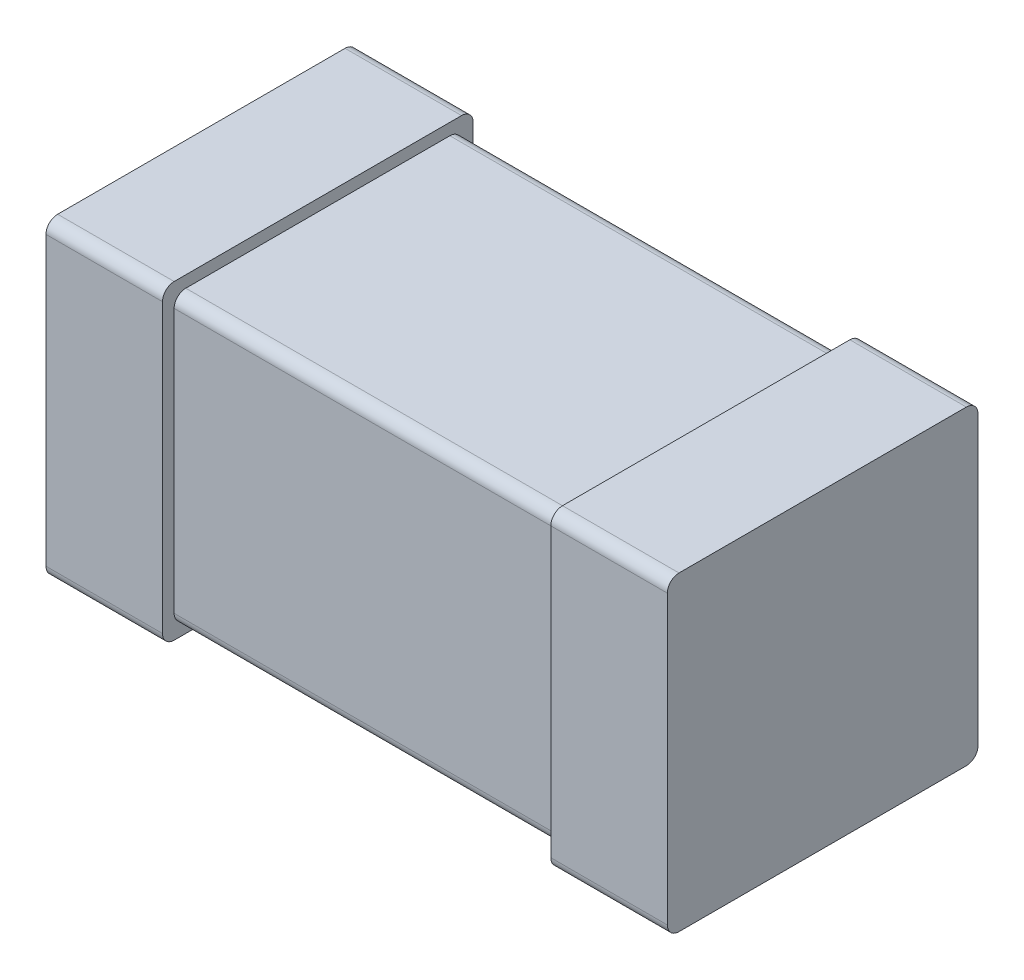
ISO-10303-21;
HEADER;
FILE_DESCRIPTION(('STEP AP214'),'2;1');
FILE_NAME('part.step','',(''),(''),'','','');
FILE_SCHEMA(('AUTOMOTIVE_DESIGN { 1 0 10303 214 1 1 1 1 }'));
ENDSEC;
DATA;
#1=APPLICATION_CONTEXT('core data for automotive mechanical design processes');
#2=APPLICATION_PROTOCOL_DEFINITION('international standard','automotive_design',2000,#1);
#3=PRODUCT_CONTEXT('',#1,'mechanical');
#4=PRODUCT('Part','Part','',(#3));
#5=PRODUCT_RELATED_PRODUCT_CATEGORY('part','',(#4));
#6=PRODUCT_DEFINITION_FORMATION('','',#4);
#7=PRODUCT_DEFINITION_CONTEXT('part definition',#1,'design');
#8=PRODUCT_DEFINITION('design','',#6,#7);
#9=PRODUCT_DEFINITION_SHAPE('','',#8);
#10=(LENGTH_UNIT() NAMED_UNIT(*) SI_UNIT(.MILLI.,.METRE.));
#11=(NAMED_UNIT(*) PLANE_ANGLE_UNIT() SI_UNIT($,.RADIAN.));
#12=(NAMED_UNIT(*) SI_UNIT($,.STERADIAN.) SOLID_ANGLE_UNIT());
#13=UNCERTAINTY_MEASURE_WITH_UNIT(LENGTH_MEASURE(1.E-05),#10,'distance_accuracy_value','');
#14=(GEOMETRIC_REPRESENTATION_CONTEXT(3) GLOBAL_UNCERTAINTY_ASSIGNED_CONTEXT((#13)) GLOBAL_UNIT_ASSIGNED_CONTEXT((#10,
#11,#12)) REPRESENTATION_CONTEXT('',''));
#15=CARTESIAN_POINT('',(0.,0.,0.));
#16=DIRECTION('',(0.,0.,1.));
#17=DIRECTION('',(1.,0.,0.));
#18=AXIS2_PLACEMENT_3D('',#15,#16,#17);
#19=CARTESIAN_POINT('',(194.464744279938,95.7010432923502,112.211582908599));
#20=DIRECTION('',(-1.,0.,0.));
#21=DIRECTION('',(0.,0.,1.));
#22=AXIS2_PLACEMENT_3D('',#19,#20,#21);
#23=PLANE('',#22);
#24=DIRECTION('',(0.,0.,1.));
#25=VECTOR('',#24,1.);
#26=CARTESIAN_POINT('',(194.464744279938,95.7010432923502,112.211582908599));
#27=LINE('',#26,#25);
#28=CARTESIAN_POINT('',(194.464744279938,95.7010432923502,112.241582908599));
#29=VERTEX_POINT('',#28);
#30=CARTESIAN_POINT('',(194.464744279938,95.7010432923502,112.981582908599));
#31=VERTEX_POINT('',#30);
#32=EDGE_CURVE('E67',#29,#31,#27,.T.);
#33=ORIENTED_EDGE('',*,*,#32,.F.);
#34=CARTESIAN_POINT('',(194.464744279938,95.6710432923502,112.241582908599));
#35=DIRECTION('',(-1.,0.,0.));
#36=DIRECTION('',(0.,0.,1.));
#37=AXIS2_PLACEMENT_3D('',#34,#35,#36);
#38=CIRCLE('',#37,0.0300000000000023);
#39=CARTESIAN_POINT('',(194.464744279938,95.6710432923502,112.211582908599));
#40=VERTEX_POINT('',#39);
#41=EDGE_CURVE('E11',#29,#40,#38,.T.);
#42=ORIENTED_EDGE('',*,*,#41,.T.);
#43=DIRECTION('',(0.,-1.,0.));
#44=VECTOR('',#43,1.);
#45=CARTESIAN_POINT('',(194.464744279938,95.7010432923502,112.211582908599));
#46=LINE('',#45,#44);
#47=CARTESIAN_POINT('',(194.464744279938,94.9310432923502,112.211582908599));
#48=VERTEX_POINT('',#47);
#49=EDGE_CURVE('E55',#40,#48,#46,.T.);
#50=ORIENTED_EDGE('',*,*,#49,.T.);
#51=CARTESIAN_POINT('',(194.464744279938,94.9310432923502,112.241582908599));
#52=DIRECTION('',(1.,0.,0.));
#53=DIRECTION('',(0.,0.,1.));
#54=AXIS2_PLACEMENT_3D('',#51,#52,#53);
#55=CIRCLE('',#54,0.0300000000000023);
#56=CARTESIAN_POINT('',(194.464744279938,94.9010432923502,112.241582908599));
#57=VERTEX_POINT('',#56);
#58=EDGE_CURVE('E303',#57,#48,#55,.T.);
#59=ORIENTED_EDGE('',*,*,#58,.F.);
#60=DIRECTION('',(0.,0.,1.));
#61=VECTOR('',#60,1.);
#62=CARTESIAN_POINT('',(194.464744279938,94.9010432923502,112.211582908599));
#63=LINE('',#62,#61);
#64=CARTESIAN_POINT('',(194.464744279938,94.9010432923502,112.981582908599));
#65=VERTEX_POINT('',#64);
#66=EDGE_CURVE('E358',#57,#65,#63,.T.);
#67=ORIENTED_EDGE('',*,*,#66,.T.);
#68=CARTESIAN_POINT('',(194.464744279938,94.9310432923502,112.981582908599));
#69=DIRECTION('',(-1.,0.,0.));
#70=DIRECTION('',(0.,0.,1.));
#71=AXIS2_PLACEMENT_3D('',#68,#69,#70);
#72=CIRCLE('',#71,0.0300000000000023);
#73=CARTESIAN_POINT('',(194.464744279938,94.9310432923502,113.011582908599));
#74=VERTEX_POINT('',#73);
#75=EDGE_CURVE('E294',#65,#74,#72,.T.);
#76=ORIENTED_EDGE('',*,*,#75,.T.);
#77=DIRECTION('',(0.,-1.,0.));
#78=VECTOR('',#77,1.);
#79=CARTESIAN_POINT('',(194.464744279938,95.7010432923502,113.011582908599));
#80=LINE('',#79,#78);
#81=CARTESIAN_POINT('',(194.464744279938,95.6710432923502,113.011582908599));
#82=VERTEX_POINT('',#81);
#83=EDGE_CURVE('E277',#82,#74,#80,.T.);
#84=ORIENTED_EDGE('',*,*,#83,.F.);
#85=CARTESIAN_POINT('',(194.464744279938,95.6710432923502,112.981582908599));
#86=DIRECTION('',(1.,0.,0.));
#87=DIRECTION('',(0.,0.,1.));
#88=AXIS2_PLACEMENT_3D('',#85,#86,#87);
#89=CIRCLE('',#88,0.0300000000000023);
#90=EDGE_CURVE('E284',#31,#82,#89,.T.);
#91=ORIENTED_EDGE('',*,*,#90,.F.);
#92=EDGE_LOOP('',(#33,#42,#50,#59,#67,#76,#84,#91));
#93=FACE_BOUND('',#92,.T.);
#94=ADVANCED_FACE('F44',(#93),#23,.T.);
#95=CARTESIAN_POINT('',(194.764744279938,94.9010432923502,112.211582908599));
#96=DIRECTION('',(0.,-1.,0.));
#97=DIRECTION('',(0.,0.,-1.));
#98=AXIS2_PLACEMENT_3D('',#95,#96,#97);
#99=PLANE('',#98);
#100=ORIENTED_EDGE('',*,*,#66,.F.);
#101=DIRECTION('',(-1.,0.,0.));
#102=VECTOR('',#101,1.);
#103=CARTESIAN_POINT('',(194.764744279938,94.9010432923502,112.241582908599));
#104=LINE('',#103,#102);
#105=CARTESIAN_POINT('',(194.764744279938,94.9010432923502,112.241582908599));
#106=VERTEX_POINT('',#105);
#107=EDGE_CURVE('E309',#106,#57,#104,.T.);
#108=ORIENTED_EDGE('',*,*,#107,.F.);
#109=DIRECTION('',(0.,0.,1.));
#110=VECTOR('',#109,1.);
#111=CARTESIAN_POINT('',(194.764744279938,94.9010432923502,112.211582908599));
#112=LINE('',#111,#110);
#113=CARTESIAN_POINT('',(194.764744279938,94.9010432923502,112.981582908599));
#114=VERTEX_POINT('',#113);
#115=EDGE_CURVE('E363',#106,#114,#112,.T.);
#116=ORIENTED_EDGE('',*,*,#115,.T.);
#117=DIRECTION('',(-1.,0.,0.));
#118=VECTOR('',#117,1.);
#119=CARTESIAN_POINT('',(194.764744279938,94.9010432923502,112.981582908599));
#120=LINE('',#119,#118);
#121=EDGE_CURVE('E372',#114,#65,#120,.T.);
#122=ORIENTED_EDGE('',*,*,#121,.T.);
#123=EDGE_LOOP('',(#100,#108,#116,#122));
#124=FACE_BOUND('',#123,.T.);
#125=ADVANCED_FACE('F592',(#124),#99,.T.);
#126=CARTESIAN_POINT('',(194.764744279938,94.9310432923502,112.981582908599));
#127=DIRECTION('',(-1.,0.,0.));
#128=DIRECTION('',(0.,-1.,0.));
#129=AXIS2_PLACEMENT_3D('',#126,#127,#128);
#130=CYLINDRICAL_SURFACE('',#129,0.0300000000000023);
#131=CARTESIAN_POINT('',(194.764744279938,94.9310432923502,112.981582908599));
#132=DIRECTION('',(-1.,0.,0.));
#133=DIRECTION('',(0.,0.,1.));
#134=AXIS2_PLACEMENT_3D('',#131,#132,#133);
#135=CIRCLE('',#134,0.0300000000000023);
#136=CARTESIAN_POINT('',(194.764744279938,94.9310432923502,113.011582908599));
#137=VERTEX_POINT('',#136);
#138=EDGE_CURVE('E415',#114,#137,#135,.T.);
#139=ORIENTED_EDGE('',*,*,#138,.T.);
#140=DIRECTION('',(-1.,0.,0.));
#141=VECTOR('',#140,1.);
#142=CARTESIAN_POINT('',(194.764744279938,94.9310432923502,113.011582908599));
#143=LINE('',#142,#141);
#144=EDGE_CURVE('E413',#137,#74,#143,.T.);
#145=ORIENTED_EDGE('',*,*,#144,.T.);
#146=ORIENTED_EDGE('',*,*,#75,.F.);
#147=ORIENTED_EDGE('',*,*,#121,.F.);
#148=EDGE_LOOP('',(#139,#145,#146,#147));
#149=FACE_BOUND('',#148,.T.);
#150=ADVANCED_FACE('F597',(#149),#130,.T.);
#151=CARTESIAN_POINT('',(194.764744279938,94.9310432923502,112.241582908599));
#152=DIRECTION('',(-1.,0.,0.));
#153=DIRECTION('',(0.,-1.,0.));
#154=AXIS2_PLACEMENT_3D('',#151,#152,#153);
#155=CYLINDRICAL_SURFACE('',#154,0.0300000000000023);
#156=ORIENTED_EDGE('',*,*,#107,.T.);
#157=ORIENTED_EDGE('',*,*,#58,.T.);
#158=DIRECTION('',(-1.,0.,0.));
#159=VECTOR('',#158,1.);
#160=CARTESIAN_POINT('',(194.764744279938,94.9310432923502,112.211582908599));
#161=LINE('',#160,#159);
#162=CARTESIAN_POINT('',(194.764744279938,94.9310432923502,112.211582908599));
#163=VERTEX_POINT('',#162);
#164=EDGE_CURVE('E297',#163,#48,#161,.T.);
#165=ORIENTED_EDGE('',*,*,#164,.F.);
#166=CARTESIAN_POINT('',(194.764744279938,94.9310432923502,112.241582908599));
#167=DIRECTION('',(1.,0.,0.));
#168=DIRECTION('',(0.,0.,1.));
#169=AXIS2_PLACEMENT_3D('',#166,#167,#168);
#170=CIRCLE('',#169,0.0300000000000023);
#171=EDGE_CURVE('E395',#106,#163,#170,.T.);
#172=ORIENTED_EDGE('',*,*,#171,.F.);
#173=EDGE_LOOP('',(#156,#157,#165,#172));
#174=FACE_BOUND('',#173,.T.);
#175=ADVANCED_FACE('F46',(#174),#155,.T.);
#176=CARTESIAN_POINT('',(194.764744279938,95.7010432923502,113.011582908599));
#177=DIRECTION('',(0.,0.,1.));
#178=DIRECTION('',(1.,0.,0.));
#179=AXIS2_PLACEMENT_3D('',#176,#177,#178);
#180=PLANE('',#179);
#181=DIRECTION('',(0.,-1.,0.));
#182=VECTOR('',#181,1.);
#183=CARTESIAN_POINT('',(194.764744279938,95.7010432923502,113.011582908599));
#184=LINE('',#183,#182);
#185=CARTESIAN_POINT('',(194.764744279938,95.6710432923502,113.011582908599));
#186=VERTEX_POINT('',#185);
#187=EDGE_CURVE('E301',#186,#137,#184,.T.);
#188=ORIENTED_EDGE('',*,*,#187,.F.);
#189=DIRECTION('',(-1.,0.,0.));
#190=VECTOR('',#189,1.);
#191=CARTESIAN_POINT('',(194.764744279938,95.6710432923502,113.011582908599));
#192=LINE('',#191,#190);
#193=EDGE_CURVE('E286',#186,#82,#192,.T.);
#194=ORIENTED_EDGE('',*,*,#193,.T.);
#195=ORIENTED_EDGE('',*,*,#83,.T.);
#196=ORIENTED_EDGE('',*,*,#144,.F.);
#197=EDGE_LOOP('',(#188,#194,#195,#196));
#198=FACE_BOUND('',#197,.T.);
#199=ADVANCED_FACE('F299',(#198),#180,.T.);
#200=CARTESIAN_POINT('',(194.764744279938,95.7010432923502,112.211582908599));
#201=DIRECTION('',(0.,0.,1.));
#202=DIRECTION('',(1.,0.,0.));
#203=AXIS2_PLACEMENT_3D('',#200,#201,#202);
#204=PLANE('',#203);
#205=ORIENTED_EDGE('',*,*,#164,.T.);
#206=ORIENTED_EDGE('',*,*,#49,.F.);
#207=DIRECTION('',(-1.,0.,0.));
#208=VECTOR('',#207,1.);
#209=CARTESIAN_POINT('',(194.764744279938,95.6710432923502,112.211582908599));
#210=LINE('',#209,#208);
#211=CARTESIAN_POINT('',(194.764744279938,95.6710432923502,112.211582908599));
#212=VERTEX_POINT('',#211);
#213=EDGE_CURVE('E407',#212,#40,#210,.T.);
#214=ORIENTED_EDGE('',*,*,#213,.F.);
#215=DIRECTION('',(0.,-1.,0.));
#216=VECTOR('',#215,1.);
#217=CARTESIAN_POINT('',(194.764744279938,95.7010432923502,112.211582908599));
#218=LINE('',#217,#216);
#219=EDGE_CURVE('E410',#212,#163,#218,.T.);
#220=ORIENTED_EDGE('',*,*,#219,.T.);
#221=EDGE_LOOP('',(#205,#206,#214,#220));
#222=FACE_BOUND('',#221,.T.);
#223=ADVANCED_FACE('F630',(#222),#204,.F.);
#224=CARTESIAN_POINT('',(194.764744279938,95.6710432923502,112.981582908599));
#225=DIRECTION('',(-1.,0.,0.));
#226=DIRECTION('',(0.,1.,0.));
#227=AXIS2_PLACEMENT_3D('',#224,#225,#226);
#228=CYLINDRICAL_SURFACE('',#227,0.0300000000000023);
#229=DIRECTION('',(-1.,0.,0.));
#230=VECTOR('',#229,1.);
#231=CARTESIAN_POINT('',(194.764744279938,95.7010432923502,112.981582908599));
#232=LINE('',#231,#230);
#233=CARTESIAN_POINT('',(194.764744279938,95.7010432923502,112.981582908599));
#234=VERTEX_POINT('',#233);
#235=EDGE_CURVE('E289',#234,#31,#232,.T.);
#236=ORIENTED_EDGE('',*,*,#235,.T.);
#237=ORIENTED_EDGE('',*,*,#90,.T.);
#238=ORIENTED_EDGE('',*,*,#193,.F.);
#239=CARTESIAN_POINT('',(194.764744279938,95.6710432923502,112.981582908599));
#240=DIRECTION('',(1.,0.,0.));
#241=DIRECTION('',(0.,0.,1.));
#242=AXIS2_PLACEMENT_3D('',#239,#240,#241);
#243=CIRCLE('',#242,0.0300000000000023);
#244=EDGE_CURVE('E328',#234,#186,#243,.T.);
#245=ORIENTED_EDGE('',*,*,#244,.F.);
#246=EDGE_LOOP('',(#236,#237,#238,#245));
#247=FACE_BOUND('',#246,.T.);
#248=ADVANCED_FACE('F285',(#247),#228,.T.);
#249=CARTESIAN_POINT('',(194.764744279938,95.6710432923502,112.241582908599));
#250=DIRECTION('',(-1.,0.,0.));
#251=DIRECTION('',(0.,1.,0.));
#252=AXIS2_PLACEMENT_3D('',#249,#250,#251);
#253=CYLINDRICAL_SURFACE('',#252,0.0300000000000023);
#254=CARTESIAN_POINT('',(194.764744279938,95.6710432923502,112.241582908599));
#255=DIRECTION('',(-1.,0.,0.));
#256=DIRECTION('',(0.,0.,1.));
#257=AXIS2_PLACEMENT_3D('',#254,#255,#256);
#258=CIRCLE('',#257,0.0300000000000023);
#259=CARTESIAN_POINT('',(194.764744279938,95.7010432923502,112.241582908599));
#260=VERTEX_POINT('',#259);
#261=EDGE_CURVE('E291',#260,#212,#258,.T.);
#262=ORIENTED_EDGE('',*,*,#261,.T.);
#263=ORIENTED_EDGE('',*,*,#213,.T.);
#264=ORIENTED_EDGE('',*,*,#41,.F.);
#265=DIRECTION('',(-1.,0.,0.));
#266=VECTOR('',#265,1.);
#267=CARTESIAN_POINT('',(194.764744279938,95.7010432923502,112.241582908599));
#268=LINE('',#267,#266);
#269=EDGE_CURVE('E48',#260,#29,#268,.T.);
#270=ORIENTED_EDGE('',*,*,#269,.F.);
#271=EDGE_LOOP('',(#262,#263,#264,#270));
#272=FACE_BOUND('',#271,.T.);
#273=ADVANCED_FACE('F608',(#272),#253,.T.);
#274=CARTESIAN_POINT('',(194.764744279938,95.7010432923502,112.211582908599));
#275=DIRECTION('',(0.,-1.,0.));
#276=DIRECTION('',(0.,0.,-1.));
#277=AXIS2_PLACEMENT_3D('',#274,#275,#276);
#278=PLANE('',#277);
#279=ORIENTED_EDGE('',*,*,#235,.F.);
#280=DIRECTION('',(0.,0.,1.));
#281=VECTOR('',#280,1.);
#282=CARTESIAN_POINT('',(194.764744279938,95.7010432923502,112.211582908599));
#283=LINE('',#282,#281);
#284=EDGE_CURVE('E391',#260,#234,#283,.T.);
#285=ORIENTED_EDGE('',*,*,#284,.F.);
#286=ORIENTED_EDGE('',*,*,#269,.T.);
#287=ORIENTED_EDGE('',*,*,#32,.T.);
#288=EDGE_LOOP('',(#279,#285,#286,#287));
#289=FACE_BOUND('',#288,.T.);
#290=ADVANCED_FACE('F611',(#289),#278,.F.);
#291=CARTESIAN_POINT('',(194.764744279938,95.7010432923502,112.211582908599));
#292=DIRECTION('',(-1.,0.,0.));
#293=DIRECTION('',(0.,0.,1.));
#294=AXIS2_PLACEMENT_3D('',#291,#292,#293);
#295=PLANE('',#294);
#296=ORIENTED_EDGE('',*,*,#244,.T.);
#297=ORIENTED_EDGE('',*,*,#187,.T.);
#298=ORIENTED_EDGE('',*,*,#138,.F.);
#299=ORIENTED_EDGE('',*,*,#115,.F.);
#300=ORIENTED_EDGE('',*,*,#171,.T.);
#301=ORIENTED_EDGE('',*,*,#219,.F.);
#302=ORIENTED_EDGE('',*,*,#261,.F.);
#303=ORIENTED_EDGE('',*,*,#284,.T.);
#304=EDGE_LOOP('',(#296,#297,#298,#299,#300,#301,#302,#303));
#305=FACE_BOUND('',#304,.T.);
#306=DIRECTION('',(0.,-1.,0.));
#307=VECTOR('',#306,1.);
#308=CARTESIAN_POINT('',(194.764744279938,95.6710432923502,112.241582908599));
#309=LINE('',#308,#307);
#310=CARTESIAN_POINT('',(194.764744279938,95.6410432923502,112.241582908599));
#311=VERTEX_POINT('',#310);
#312=CARTESIAN_POINT('',(194.764744279938,94.9610432923502,112.241582908599));
#313=VERTEX_POINT('',#312);
#314=EDGE_CURVE('E396',#311,#313,#309,.T.);
#315=ORIENTED_EDGE('',*,*,#314,.T.);
#316=CARTESIAN_POINT('',(194.764744279938,94.9610432923502,112.271582908599));
#317=DIRECTION('',(1.,0.,0.));
#318=DIRECTION('',(0.,0.,1.));
#319=AXIS2_PLACEMENT_3D('',#316,#317,#318);
#320=CIRCLE('',#319,0.0300000000000023);
#321=CARTESIAN_POINT('',(194.764744279938,94.9310432923502,112.271582908599));
#322=VERTEX_POINT('',#321);
#323=EDGE_CURVE('E384',#322,#313,#320,.T.);
#324=ORIENTED_EDGE('',*,*,#323,.F.);
#325=DIRECTION('',(0.,0.,1.));
#326=VECTOR('',#325,1.);
#327=CARTESIAN_POINT('',(194.764744279938,94.9310432923502,112.241582908599));
#328=LINE('',#327,#326);
#329=CARTESIAN_POINT('',(194.764744279938,94.9310432923502,112.951582908599));
#330=VERTEX_POINT('',#329);
#331=EDGE_CURVE('E417',#322,#330,#328,.T.);
#332=ORIENTED_EDGE('',*,*,#331,.T.);
#333=CARTESIAN_POINT('',(194.764744279938,94.9610432923502,112.951582908599));
#334=DIRECTION('',(-1.,0.,0.));
#335=DIRECTION('',(0.,0.,1.));
#336=AXIS2_PLACEMENT_3D('',#333,#334,#335);
#337=CIRCLE('',#336,0.0300000000000023);
#338=CARTESIAN_POINT('',(194.764744279938,94.9610432923502,112.981582908599));
#339=VERTEX_POINT('',#338);
#340=EDGE_CURVE('E116',#330,#339,#337,.T.);
#341=ORIENTED_EDGE('',*,*,#340,.T.);
#342=DIRECTION('',(0.,-1.,0.));
#343=VECTOR('',#342,1.);
#344=CARTESIAN_POINT('',(194.764744279938,95.6710432923502,112.981582908599));
#345=LINE('',#344,#343);
#346=CARTESIAN_POINT('',(194.764744279938,95.6410432923502,112.981582908599));
#347=VERTEX_POINT('',#346);
#348=EDGE_CURVE('E132',#347,#339,#345,.T.);
#349=ORIENTED_EDGE('',*,*,#348,.F.);
#350=CARTESIAN_POINT('',(194.764744279938,95.6410432923502,112.951582908599));
#351=DIRECTION('',(1.,0.,0.));
#352=DIRECTION('',(0.,0.,1.));
#353=AXIS2_PLACEMENT_3D('',#350,#351,#352);
#354=CIRCLE('',#353,0.0300000000000023);
#355=CARTESIAN_POINT('',(194.764744279938,95.6710432923502,112.951582908599));
#356=VERTEX_POINT('',#355);
#357=EDGE_CURVE('E344',#356,#347,#354,.T.);
#358=ORIENTED_EDGE('',*,*,#357,.F.);
#359=DIRECTION('',(0.,0.,1.));
#360=VECTOR('',#359,1.);
#361=CARTESIAN_POINT('',(194.764744279938,95.6710432923502,112.241582908599));
#362=LINE('',#361,#360);
#363=CARTESIAN_POINT('',(194.764744279938,95.6710432923502,112.271582908599));
#364=VERTEX_POINT('',#363);
#365=EDGE_CURVE('E173',#364,#356,#362,.T.);
#366=ORIENTED_EDGE('',*,*,#365,.F.);
#367=CARTESIAN_POINT('',(194.764744279938,95.6410432923502,112.271582908599));
#368=DIRECTION('',(-1.,0.,0.));
#369=DIRECTION('',(0.,0.,1.));
#370=AXIS2_PLACEMENT_3D('',#367,#368,#369);
#371=CIRCLE('',#370,0.0300000000000023);
#372=EDGE_CURVE('E182',#364,#311,#371,.T.);
#373=ORIENTED_EDGE('',*,*,#372,.T.);
#374=EDGE_LOOP('',(#315,#324,#332,#341,#349,#358,#366,#373));
#375=FACE_BOUND('',#374,.T.);
#376=ADVANCED_FACE('F513',(#305,#375),#295,.F.);
#377=CARTESIAN_POINT('',(195.764744279938,95.6710432923502,112.241582908599));
#378=DIRECTION('',(0.,-1.,0.));
#379=DIRECTION('',(0.,0.,-1.));
#380=AXIS2_PLACEMENT_3D('',#377,#378,#379);
#381=PLANE('',#380);
#382=DIRECTION('',(-1.,0.,0.));
#383=VECTOR('',#382,1.);
#384=CARTESIAN_POINT('',(195.764744279938,95.6710432923502,112.951582908599));
#385=LINE('',#384,#383);
#386=CARTESIAN_POINT('',(195.764744279938,95.6710432923502,112.951582908599));
#387=VERTEX_POINT('',#386);
#388=EDGE_CURVE('E341',#387,#356,#385,.T.);
#389=ORIENTED_EDGE('',*,*,#388,.F.);
#390=DIRECTION('',(0.,0.,1.));
#391=VECTOR('',#390,1.);
#392=CARTESIAN_POINT('',(195.764744279938,95.6710432923502,112.241582908599));
#393=LINE('',#392,#391);
#394=CARTESIAN_POINT('',(195.764744279938,95.6710432923502,112.271582908599));
#395=VERTEX_POINT('',#394);
#396=EDGE_CURVE('E368',#395,#387,#393,.T.);
#397=ORIENTED_EDGE('',*,*,#396,.F.);
#398=DIRECTION('',(-1.,0.,0.));
#399=VECTOR('',#398,1.);
#400=CARTESIAN_POINT('',(195.764744279938,95.6710432923502,112.271582908599));
#401=LINE('',#400,#399);
#402=EDGE_CURVE('E315',#395,#364,#401,.T.);
#403=ORIENTED_EDGE('',*,*,#402,.T.);
#404=ORIENTED_EDGE('',*,*,#365,.T.);
#405=EDGE_LOOP('',(#389,#397,#403,#404));
#406=FACE_BOUND('',#405,.T.);
#407=ADVANCED_FACE('F577',(#406),#381,.F.);
#408=CARTESIAN_POINT('',(195.764744279938,95.6410432923502,112.951582908599));
#409=DIRECTION('',(-1.,0.,0.));
#410=DIRECTION('',(0.,1.,0.));
#411=AXIS2_PLACEMENT_3D('',#408,#409,#410);
#412=CYLINDRICAL_SURFACE('',#411,0.0300000000000023);
#413=ORIENTED_EDGE('',*,*,#388,.T.);
#414=ORIENTED_EDGE('',*,*,#357,.T.);
#415=DIRECTION('',(-1.,0.,0.));
#416=VECTOR('',#415,1.);
#417=CARTESIAN_POINT('',(195.764744279938,95.6410432923502,112.981582908599));
#418=LINE('',#417,#416);
#419=CARTESIAN_POINT('',(195.764744279938,95.6410432923502,112.981582908599));
#420=VERTEX_POINT('',#419);
#421=EDGE_CURVE('E361',#420,#347,#418,.T.);
#422=ORIENTED_EDGE('',*,*,#421,.F.);
#423=CARTESIAN_POINT('',(195.764744279938,95.6410432923502,112.951582908599));
#424=DIRECTION('',(1.,0.,0.));
#425=DIRECTION('',(0.,0.,1.));
#426=AXIS2_PLACEMENT_3D('',#423,#424,#425);
#427=CIRCLE('',#426,0.0300000000000023);
#428=EDGE_CURVE('E443',#387,#420,#427,.T.);
#429=ORIENTED_EDGE('',*,*,#428,.F.);
#430=EDGE_LOOP('',(#413,#414,#422,#429));
#431=FACE_BOUND('',#430,.T.);
#432=ADVANCED_FACE('F575',(#431),#412,.T.);
#433=CARTESIAN_POINT('',(195.764744279938,95.6710432923502,112.981582908599));
#434=DIRECTION('',(0.,0.,1.));
#435=DIRECTION('',(1.,0.,0.));
#436=AXIS2_PLACEMENT_3D('',#433,#434,#435);
#437=PLANE('',#436);
#438=DIRECTION('',(0.,-1.,0.));
#439=VECTOR('',#438,1.);
#440=CARTESIAN_POINT('',(195.764744279938,95.6710432923502,112.981582908599));
#441=LINE('',#440,#439);
#442=CARTESIAN_POINT('',(195.764744279938,94.9610432923502,112.981582908599));
#443=VERTEX_POINT('',#442);
#444=EDGE_CURVE('E332',#420,#443,#441,.T.);
#445=ORIENTED_EDGE('',*,*,#444,.F.);
#446=ORIENTED_EDGE('',*,*,#421,.T.);
#447=ORIENTED_EDGE('',*,*,#348,.T.);
#448=DIRECTION('',(-1.,0.,0.));
#449=VECTOR('',#448,1.);
#450=CARTESIAN_POINT('',(195.764744279938,94.9610432923502,112.981582908599));
#451=LINE('',#450,#449);
#452=EDGE_CURVE('E318',#443,#339,#451,.T.);
#453=ORIENTED_EDGE('',*,*,#452,.F.);
#454=EDGE_LOOP('',(#445,#446,#447,#453));
#455=FACE_BOUND('',#454,.T.);
#456=ADVANCED_FACE('F570',(#455),#437,.T.);
#457=CARTESIAN_POINT('',(195.764744279938,94.9610432923502,112.951582908599));
#458=DIRECTION('',(-1.,0.,0.));
#459=DIRECTION('',(0.,-1.,0.));
#460=AXIS2_PLACEMENT_3D('',#457,#458,#459);
#461=CYLINDRICAL_SURFACE('',#460,0.0300000000000023);
#462=CARTESIAN_POINT('',(195.764744279938,94.9610432923502,112.951582908599));
#463=DIRECTION('',(-1.,0.,0.));
#464=DIRECTION('',(0.,0.,1.));
#465=AXIS2_PLACEMENT_3D('',#462,#463,#464);
#466=CIRCLE('',#465,0.0300000000000023);
#467=CARTESIAN_POINT('',(195.764744279938,94.9310432923502,112.951582908599));
#468=VERTEX_POINT('',#467);
#469=EDGE_CURVE('E321',#468,#443,#466,.T.);
#470=ORIENTED_EDGE('',*,*,#469,.T.);
#471=ORIENTED_EDGE('',*,*,#452,.T.);
#472=ORIENTED_EDGE('',*,*,#340,.F.);
#473=DIRECTION('',(-1.,0.,0.));
#474=VECTOR('',#473,1.);
#475=CARTESIAN_POINT('',(195.764744279938,94.9310432923502,112.951582908599));
#476=LINE('',#475,#474);
#477=EDGE_CURVE('E379',#468,#330,#476,.T.);
#478=ORIENTED_EDGE('',*,*,#477,.F.);
#479=EDGE_LOOP('',(#470,#471,#472,#478));
#480=FACE_BOUND('',#479,.T.);
#481=ADVANCED_FACE('F568',(#480),#461,.T.);
#482=CARTESIAN_POINT('',(195.764744279938,94.9310432923502,112.241582908599));
#483=DIRECTION('',(0.,-1.,0.));
#484=DIRECTION('',(0.,0.,-1.));
#485=AXIS2_PLACEMENT_3D('',#482,#483,#484);
#486=PLANE('',#485);
#487=ORIENTED_EDGE('',*,*,#331,.F.);
#488=DIRECTION('',(-1.,0.,0.));
#489=VECTOR('',#488,1.);
#490=CARTESIAN_POINT('',(195.764744279938,94.9310432923502,112.271582908599));
#491=LINE('',#490,#489);
#492=CARTESIAN_POINT('',(195.764744279938,94.9310432923502,112.271582908599));
#493=VERTEX_POINT('',#492);
#494=EDGE_CURVE('E383',#493,#322,#491,.T.);
#495=ORIENTED_EDGE('',*,*,#494,.F.);
#496=DIRECTION('',(0.,0.,1.));
#497=VECTOR('',#496,1.);
#498=CARTESIAN_POINT('',(195.764744279938,94.9310432923502,112.241582908599));
#499=LINE('',#498,#497);
#500=EDGE_CURVE('E322',#493,#468,#499,.T.);
#501=ORIENTED_EDGE('',*,*,#500,.T.);
#502=ORIENTED_EDGE('',*,*,#477,.T.);
#503=EDGE_LOOP('',(#487,#495,#501,#502));
#504=FACE_BOUND('',#503,.T.);
#505=ADVANCED_FACE('F527',(#504),#486,.T.);
#506=CARTESIAN_POINT('',(195.764744279938,94.9610432923502,112.271582908599));
#507=DIRECTION('',(-1.,0.,0.));
#508=DIRECTION('',(0.,-1.,0.));
#509=AXIS2_PLACEMENT_3D('',#506,#507,#508);
#510=CYLINDRICAL_SURFACE('',#509,0.0300000000000023);
#511=ORIENTED_EDGE('',*,*,#494,.T.);
#512=ORIENTED_EDGE('',*,*,#323,.T.);
#513=DIRECTION('',(-1.,0.,0.));
#514=VECTOR('',#513,1.);
#515=CARTESIAN_POINT('',(195.764744279938,94.9610432923502,112.241582908599));
#516=LINE('',#515,#514);
#517=CARTESIAN_POINT('',(195.764744279938,94.9610432923502,112.241582908599));
#518=VERTEX_POINT('',#517);
#519=EDGE_CURVE('E387',#518,#313,#516,.T.);
#520=ORIENTED_EDGE('',*,*,#519,.F.);
#521=CARTESIAN_POINT('',(195.764744279938,94.9610432923502,112.271582908599));
#522=DIRECTION('',(1.,0.,0.));
#523=DIRECTION('',(0.,0.,1.));
#524=AXIS2_PLACEMENT_3D('',#521,#522,#523);
#525=CIRCLE('',#524,0.0300000000000023);
#526=EDGE_CURVE('E329',#493,#518,#525,.T.);
#527=ORIENTED_EDGE('',*,*,#526,.F.);
#528=EDGE_LOOP('',(#511,#512,#520,#527));
#529=FACE_BOUND('',#528,.T.);
#530=ADVANCED_FACE('F523',(#529),#510,.T.);
#531=CARTESIAN_POINT('',(195.764744279938,95.6710432923502,112.241582908599));
#532=DIRECTION('',(0.,0.,1.));
#533=DIRECTION('',(1.,0.,0.));
#534=AXIS2_PLACEMENT_3D('',#531,#532,#533);
#535=PLANE('',#534);
#536=ORIENTED_EDGE('',*,*,#519,.T.);
#537=ORIENTED_EDGE('',*,*,#314,.F.);
#538=DIRECTION('',(-1.,0.,0.));
#539=VECTOR('',#538,1.);
#540=CARTESIAN_POINT('',(195.764744279938,95.6410432923502,112.241582908599));
#541=LINE('',#540,#539);
#542=CARTESIAN_POINT('',(195.764744279938,95.6410432923502,112.241582908599));
#543=VERTEX_POINT('',#542);
#544=EDGE_CURVE('E340',#543,#311,#541,.T.);
#545=ORIENTED_EDGE('',*,*,#544,.F.);
#546=DIRECTION('',(0.,-1.,0.));
#547=VECTOR('',#546,1.);
#548=CARTESIAN_POINT('',(195.764744279938,95.6710432923502,112.241582908599));
#549=LINE('',#548,#547);
#550=EDGE_CURVE('E478',#543,#518,#549,.T.);
#551=ORIENTED_EDGE('',*,*,#550,.T.);
#552=EDGE_LOOP('',(#536,#537,#545,#551));
#553=FACE_BOUND('',#552,.T.);
#554=ADVANCED_FACE('F519',(#553),#535,.F.);
#555=CARTESIAN_POINT('',(195.764744279938,95.6410432923502,112.271582908599));
#556=DIRECTION('',(-1.,0.,0.));
#557=DIRECTION('',(0.,1.,0.));
#558=AXIS2_PLACEMENT_3D('',#555,#556,#557);
#559=CYLINDRICAL_SURFACE('',#558,0.0300000000000023);
#560=CARTESIAN_POINT('',(195.764744279938,95.6410432923502,112.271582908599));
#561=DIRECTION('',(-1.,0.,0.));
#562=DIRECTION('',(0.,0.,1.));
#563=AXIS2_PLACEMENT_3D('',#560,#561,#562);
#564=CIRCLE('',#563,0.0300000000000023);
#565=EDGE_CURVE('E508',#395,#543,#564,.T.);
#566=ORIENTED_EDGE('',*,*,#565,.T.);
#567=ORIENTED_EDGE('',*,*,#544,.T.);
#568=ORIENTED_EDGE('',*,*,#372,.F.);
#569=ORIENTED_EDGE('',*,*,#402,.F.);
#570=EDGE_LOOP('',(#566,#567,#568,#569));
#571=FACE_BOUND('',#570,.T.);
#572=ADVANCED_FACE('F580',(#571),#559,.T.);
#573=CARTESIAN_POINT('',(195.764744279938,95.7010432923502,112.211582908599));
#574=DIRECTION('',(-1.,0.,0.));
#575=DIRECTION('',(0.,0.,1.));
#576=AXIS2_PLACEMENT_3D('',#573,#574,#575);
#577=PLANE('',#576);
#578=DIRECTION('',(0.,0.,1.));
#579=VECTOR('',#578,1.);
#580=CARTESIAN_POINT('',(195.764744279938,95.7010432923502,112.211582908599));
#581=LINE('',#580,#579);
#582=CARTESIAN_POINT('',(195.764744279938,95.7010432923502,112.241582908599));
#583=VERTEX_POINT('',#582);
#584=CARTESIAN_POINT('',(195.764744279938,95.7010432923502,112.981582908599));
#585=VERTEX_POINT('',#584);
#586=EDGE_CURVE('E456',#583,#585,#581,.T.);
#587=ORIENTED_EDGE('',*,*,#586,.F.);
#588=CARTESIAN_POINT('',(195.764744279938,95.6710432923502,112.241582908599));
#589=DIRECTION('',(-1.,0.,0.));
#590=DIRECTION('',(0.,0.,1.));
#591=AXIS2_PLACEMENT_3D('',#588,#589,#590);
#592=CIRCLE('',#591,0.0300000000000023);
#593=CARTESIAN_POINT('',(195.764744279938,95.6710432923502,112.211582908599));
#594=VERTEX_POINT('',#593);
#595=EDGE_CURVE('E336',#583,#594,#592,.T.);
#596=ORIENTED_EDGE('',*,*,#595,.T.);
#597=DIRECTION('',(0.,-1.,0.));
#598=VECTOR('',#597,1.);
#599=CARTESIAN_POINT('',(195.764744279938,95.7010432923502,112.211582908599));
#600=LINE('',#599,#598);
#601=CARTESIAN_POINT('',(195.764744279938,94.9310432923502,112.211582908599));
#602=VERTEX_POINT('',#601);
#603=EDGE_CURVE('E259',#594,#602,#600,.T.);
#604=ORIENTED_EDGE('',*,*,#603,.T.);
#605=CARTESIAN_POINT('',(195.764744279938,94.9310432923502,112.241582908599));
#606=DIRECTION('',(1.,0.,0.));
#607=DIRECTION('',(0.,0.,1.));
#608=AXIS2_PLACEMENT_3D('',#605,#606,#607);
#609=CIRCLE('',#608,0.0300000000000023);
#610=CARTESIAN_POINT('',(195.764744279938,94.9010432923502,112.241582908599));
#611=VERTEX_POINT('',#610);
#612=EDGE_CURVE('E248',#611,#602,#609,.T.);
#613=ORIENTED_EDGE('',*,*,#612,.F.);
#614=DIRECTION('',(0.,0.,1.));
#615=VECTOR('',#614,1.);
#616=CARTESIAN_POINT('',(195.764744279938,94.9010432923502,112.211582908599));
#617=LINE('',#616,#615);
#618=CARTESIAN_POINT('',(195.764744279938,94.9010432923502,112.981582908599));
#619=VERTEX_POINT('',#618);
#620=EDGE_CURVE('E337',#611,#619,#617,.T.);
#621=ORIENTED_EDGE('',*,*,#620,.T.);
#622=CARTESIAN_POINT('',(195.764744279938,94.9310432923502,112.981582908599));
#623=DIRECTION('',(-1.,0.,0.));
#624=DIRECTION('',(0.,0.,1.));
#625=AXIS2_PLACEMENT_3D('',#622,#623,#624);
#626=CIRCLE('',#625,0.0300000000000023);
#627=CARTESIAN_POINT('',(195.764744279938,94.9310432923502,113.011582908599));
#628=VERTEX_POINT('',#627);
#629=EDGE_CURVE('E349',#619,#628,#626,.T.);
#630=ORIENTED_EDGE('',*,*,#629,.T.);
#631=DIRECTION('',(0.,-1.,0.));
#632=VECTOR('',#631,1.);
#633=CARTESIAN_POINT('',(195.764744279938,95.7010432923502,113.011582908599));
#634=LINE('',#633,#632);
#635=CARTESIAN_POINT('',(195.764744279938,95.6710432923502,113.011582908599));
#636=VERTEX_POINT('',#635);
#637=EDGE_CURVE('E373',#636,#628,#634,.T.);
#638=ORIENTED_EDGE('',*,*,#637,.F.);
#639=CARTESIAN_POINT('',(195.764744279938,95.6710432923502,112.981582908599));
#640=DIRECTION('',(1.,0.,0.));
#641=DIRECTION('',(0.,0.,1.));
#642=AXIS2_PLACEMENT_3D('',#639,#640,#641);
#643=CIRCLE('',#642,0.0300000000000023);
#644=EDGE_CURVE('E401',#585,#636,#643,.T.);
#645=ORIENTED_EDGE('',*,*,#644,.F.);
#646=EDGE_LOOP('',(#587,#596,#604,#613,#621,#630,#638,#645));
#647=FACE_BOUND('',#646,.T.);
#648=ORIENTED_EDGE('',*,*,#565,.F.);
#649=ORIENTED_EDGE('',*,*,#396,.T.);
#650=ORIENTED_EDGE('',*,*,#428,.T.);
#651=ORIENTED_EDGE('',*,*,#444,.T.);
#652=ORIENTED_EDGE('',*,*,#469,.F.);
#653=ORIENTED_EDGE('',*,*,#500,.F.);
#654=ORIENTED_EDGE('',*,*,#526,.T.);
#655=ORIENTED_EDGE('',*,*,#550,.F.);
#656=EDGE_LOOP('',(#648,#649,#650,#651,#652,#653,#654,#655));
#657=FACE_BOUND('',#656,.T.);
#658=ADVANCED_FACE('F531',(#647,#657),#577,.T.);
#659=CARTESIAN_POINT('',(196.064744279938,94.9010432923502,112.211582908599));
#660=DIRECTION('',(0.,-1.,0.));
#661=DIRECTION('',(0.,0.,-1.));
#662=AXIS2_PLACEMENT_3D('',#659,#660,#661);
#663=PLANE('',#662);
#664=ORIENTED_EDGE('',*,*,#620,.F.);
#665=DIRECTION('',(-1.,0.,0.));
#666=VECTOR('',#665,1.);
#667=CARTESIAN_POINT('',(196.064744279938,94.9010432923502,112.241582908599));
#668=LINE('',#667,#666);
#669=CARTESIAN_POINT('',(196.064744279938,94.9010432923502,112.241582908599));
#670=VERTEX_POINT('',#669);
#671=EDGE_CURVE('E474',#670,#611,#668,.T.);
#672=ORIENTED_EDGE('',*,*,#671,.F.);
#673=DIRECTION('',(0.,0.,1.));
#674=VECTOR('',#673,1.);
#675=CARTESIAN_POINT('',(196.064744279938,94.9010432923502,112.211582908599));
#676=LINE('',#675,#674);
#677=CARTESIAN_POINT('',(196.064744279938,94.9010432923502,112.981582908599));
#678=VERTEX_POINT('',#677);
#679=EDGE_CURVE('E333',#670,#678,#676,.T.);
#680=ORIENTED_EDGE('',*,*,#679,.T.);
#681=DIRECTION('',(-1.,0.,0.));
#682=VECTOR('',#681,1.);
#683=CARTESIAN_POINT('',(196.064744279938,94.9010432923502,112.981582908599));
#684=LINE('',#683,#682);
#685=EDGE_CURVE('E350',#678,#619,#684,.T.);
#686=ORIENTED_EDGE('',*,*,#685,.T.);
#687=EDGE_LOOP('',(#664,#672,#680,#686));
#688=FACE_BOUND('',#687,.T.);
#689=ADVANCED_FACE('F587',(#688),#663,.T.);
#690=CARTESIAN_POINT('',(196.064744279938,94.9310432923502,112.981582908599));
#691=DIRECTION('',(-1.,0.,0.));
#692=DIRECTION('',(0.,-1.,0.));
#693=AXIS2_PLACEMENT_3D('',#690,#691,#692);
#694=CYLINDRICAL_SURFACE('',#693,0.0300000000000023);
#695=CARTESIAN_POINT('',(196.064744279938,94.9310432923502,112.981582908599));
#696=DIRECTION('',(-1.,0.,0.));
#697=DIRECTION('',(0.,0.,1.));
#698=AXIS2_PLACEMENT_3D('',#695,#696,#697);
#699=CIRCLE('',#698,0.0300000000000023);
#700=CARTESIAN_POINT('',(196.064744279938,94.9310432923502,113.011582908599));
#701=VERTEX_POINT('',#700);
#702=EDGE_CURVE('E354',#678,#701,#699,.T.);
#703=ORIENTED_EDGE('',*,*,#702,.T.);
#704=DIRECTION('',(-1.,0.,0.));
#705=VECTOR('',#704,1.);
#706=CARTESIAN_POINT('',(196.064744279938,94.9310432923502,113.011582908599));
#707=LINE('',#706,#705);
#708=EDGE_CURVE('E440',#701,#628,#707,.T.);
#709=ORIENTED_EDGE('',*,*,#708,.T.);
#710=ORIENTED_EDGE('',*,*,#629,.F.);
#711=ORIENTED_EDGE('',*,*,#685,.F.);
#712=EDGE_LOOP('',(#703,#709,#710,#711));
#713=FACE_BOUND('',#712,.T.);
#714=ADVANCED_FACE('F637',(#713),#694,.T.);
#715=CARTESIAN_POINT('',(196.064744279938,94.9310432923502,112.241582908599));
#716=DIRECTION('',(-1.,0.,0.));
#717=DIRECTION('',(0.,-1.,0.));
#718=AXIS2_PLACEMENT_3D('',#715,#716,#717);
#719=CYLINDRICAL_SURFACE('',#718,0.0300000000000023);
#720=ORIENTED_EDGE('',*,*,#671,.T.);
#721=ORIENTED_EDGE('',*,*,#612,.T.);
#722=DIRECTION('',(-1.,0.,0.));
#723=VECTOR('',#722,1.);
#724=CARTESIAN_POINT('',(196.064744279938,94.9310432923502,112.211582908599));
#725=LINE('',#724,#723);
#726=CARTESIAN_POINT('',(196.064744279938,94.9310432923502,112.211582908599));
#727=VERTEX_POINT('',#726);
#728=EDGE_CURVE('E378',#727,#602,#725,.T.);
#729=ORIENTED_EDGE('',*,*,#728,.F.);
#730=CARTESIAN_POINT('',(196.064744279938,94.9310432923502,112.241582908599));
#731=DIRECTION('',(1.,0.,0.));
#732=DIRECTION('',(0.,0.,1.));
#733=AXIS2_PLACEMENT_3D('',#730,#731,#732);
#734=CIRCLE('',#733,0.0300000000000023);
#735=EDGE_CURVE('E460',#670,#727,#734,.T.);
#736=ORIENTED_EDGE('',*,*,#735,.F.);
#737=EDGE_LOOP('',(#720,#721,#729,#736));
#738=FACE_BOUND('',#737,.T.);
#739=ADVANCED_FACE('F607',(#738),#719,.T.);
#740=CARTESIAN_POINT('',(196.064744279938,95.7010432923502,113.011582908599));
#741=DIRECTION('',(0.,0.,1.));
#742=DIRECTION('',(1.,0.,0.));
#743=AXIS2_PLACEMENT_3D('',#740,#741,#742);
#744=PLANE('',#743);
#745=DIRECTION('',(0.,-1.,0.));
#746=VECTOR('',#745,1.);
#747=CARTESIAN_POINT('',(196.064744279938,95.7010432923502,113.011582908599));
#748=LINE('',#747,#746);
#749=CARTESIAN_POINT('',(196.064744279938,95.6710432923502,113.011582908599));
#750=VERTEX_POINT('',#749);
#751=EDGE_CURVE('E457',#750,#701,#748,.T.);
#752=ORIENTED_EDGE('',*,*,#751,.F.);
#753=DIRECTION('',(-1.,0.,0.));
#754=VECTOR('',#753,1.);
#755=CARTESIAN_POINT('',(196.064744279938,95.6710432923502,113.011582908599));
#756=LINE('',#755,#754);
#757=EDGE_CURVE('E377',#750,#636,#756,.T.);
#758=ORIENTED_EDGE('',*,*,#757,.T.);
#759=ORIENTED_EDGE('',*,*,#637,.T.);
#760=ORIENTED_EDGE('',*,*,#708,.F.);
#761=EDGE_LOOP('',(#752,#758,#759,#760));
#762=FACE_BOUND('',#761,.T.);
#763=ADVANCED_FACE('F555',(#762),#744,.T.);
#764=CARTESIAN_POINT('',(196.064744279938,95.7010432923502,112.211582908599));
#765=DIRECTION('',(0.,0.,1.));
#766=DIRECTION('',(1.,0.,0.));
#767=AXIS2_PLACEMENT_3D('',#764,#765,#766);
#768=PLANE('',#767);
#769=ORIENTED_EDGE('',*,*,#728,.T.);
#770=ORIENTED_EDGE('',*,*,#603,.F.);
#771=DIRECTION('',(-1.,0.,0.));
#772=VECTOR('',#771,1.);
#773=CARTESIAN_POINT('',(196.064744279938,95.6710432923502,112.211582908599));
#774=LINE('',#773,#772);
#775=CARTESIAN_POINT('',(196.064744279938,95.6710432923502,112.211582908599));
#776=VERTEX_POINT('',#775);
#777=EDGE_CURVE('E430',#776,#594,#774,.T.);
#778=ORIENTED_EDGE('',*,*,#777,.F.);
#779=DIRECTION('',(0.,-1.,0.));
#780=VECTOR('',#779,1.);
#781=CARTESIAN_POINT('',(196.064744279938,95.7010432923502,112.211582908599));
#782=LINE('',#781,#780);
#783=EDGE_CURVE('E390',#776,#727,#782,.T.);
#784=ORIENTED_EDGE('',*,*,#783,.T.);
#785=EDGE_LOOP('',(#769,#770,#778,#784));
#786=FACE_BOUND('',#785,.T.);
#787=ADVANCED_FACE('F602',(#786),#768,.F.);
#788=CARTESIAN_POINT('',(196.064744279938,95.6710432923502,112.981582908599));
#789=DIRECTION('',(-1.,0.,0.));
#790=DIRECTION('',(0.,1.,0.));
#791=AXIS2_PLACEMENT_3D('',#788,#789,#790);
#792=CYLINDRICAL_SURFACE('',#791,0.0300000000000023);
#793=DIRECTION('',(-1.,0.,0.));
#794=VECTOR('',#793,1.);
#795=CARTESIAN_POINT('',(196.064744279938,95.7010432923502,112.981582908599));
#796=LINE('',#795,#794);
#797=CARTESIAN_POINT('',(196.064744279938,95.7010432923502,112.981582908599));
#798=VERTEX_POINT('',#797);
#799=EDGE_CURVE('E397',#798,#585,#796,.T.);
#800=ORIENTED_EDGE('',*,*,#799,.T.);
#801=ORIENTED_EDGE('',*,*,#644,.T.);
#802=ORIENTED_EDGE('',*,*,#757,.F.);
#803=CARTESIAN_POINT('',(196.064744279938,95.6710432923502,112.981582908599));
#804=DIRECTION('',(1.,0.,0.));
#805=DIRECTION('',(0.,0.,1.));
#806=AXIS2_PLACEMENT_3D('',#803,#804,#805);
#807=CIRCLE('',#806,0.0300000000000023);
#808=EDGE_CURVE('E452',#798,#750,#807,.T.);
#809=ORIENTED_EDGE('',*,*,#808,.F.);
#810=EDGE_LOOP('',(#800,#801,#802,#809));
#811=FACE_BOUND('',#810,.T.);
#812=ADVANCED_FACE('F557',(#811),#792,.T.);
#813=CARTESIAN_POINT('',(196.064744279938,95.6710432923502,112.241582908599));
#814=DIRECTION('',(-1.,0.,0.));
#815=DIRECTION('',(0.,1.,0.));
#816=AXIS2_PLACEMENT_3D('',#813,#814,#815);
#817=CYLINDRICAL_SURFACE('',#816,0.0300000000000023);
#818=CARTESIAN_POINT('',(196.064744279938,95.6710432923502,112.241582908599));
#819=DIRECTION('',(-1.,0.,0.));
#820=DIRECTION('',(0.,0.,1.));
#821=AXIS2_PLACEMENT_3D('',#818,#819,#820);
#822=CIRCLE('',#821,0.0300000000000023);
#823=CARTESIAN_POINT('',(196.064744279938,95.7010432923502,112.241582908599));
#824=VERTEX_POINT('',#823);
#825=EDGE_CURVE('E432',#824,#776,#822,.T.);
#826=ORIENTED_EDGE('',*,*,#825,.T.);
#827=ORIENTED_EDGE('',*,*,#777,.T.);
#828=ORIENTED_EDGE('',*,*,#595,.F.);
#829=DIRECTION('',(-1.,0.,0.));
#830=VECTOR('',#829,1.);
#831=CARTESIAN_POINT('',(196.064744279938,95.7010432923502,112.241582908599));
#832=LINE('',#831,#830);
#833=EDGE_CURVE('E313',#824,#583,#832,.T.);
#834=ORIENTED_EDGE('',*,*,#833,.F.);
#835=EDGE_LOOP('',(#826,#827,#828,#834));
#836=FACE_BOUND('',#835,.T.);
#837=ADVANCED_FACE('F619',(#836),#817,.T.);
#838=CARTESIAN_POINT('',(196.064744279938,95.7010432923502,112.211582908599));
#839=DIRECTION('',(0.,-1.,0.));
#840=DIRECTION('',(0.,0.,-1.));
#841=AXIS2_PLACEMENT_3D('',#838,#839,#840);
#842=PLANE('',#841);
#843=ORIENTED_EDGE('',*,*,#799,.F.);
#844=DIRECTION('',(0.,0.,1.));
#845=VECTOR('',#844,1.);
#846=CARTESIAN_POINT('',(196.064744279938,95.7010432923502,112.211582908599));
#847=LINE('',#846,#845);
#848=EDGE_CURVE('E463',#824,#798,#847,.T.);
#849=ORIENTED_EDGE('',*,*,#848,.F.);
#850=ORIENTED_EDGE('',*,*,#833,.T.);
#851=ORIENTED_EDGE('',*,*,#586,.T.);
#852=EDGE_LOOP('',(#843,#849,#850,#851));
#853=FACE_BOUND('',#852,.T.);
#854=ADVANCED_FACE('F615',(#853),#842,.F.);
#855=CARTESIAN_POINT('',(196.064744279938,95.7010432923502,112.211582908599));
#856=DIRECTION('',(-1.,0.,0.));
#857=DIRECTION('',(0.,0.,1.));
#858=AXIS2_PLACEMENT_3D('',#855,#856,#857);
#859=PLANE('',#858);
#860=ORIENTED_EDGE('',*,*,#808,.T.);
#861=ORIENTED_EDGE('',*,*,#751,.T.);
#862=ORIENTED_EDGE('',*,*,#702,.F.);
#863=ORIENTED_EDGE('',*,*,#679,.F.);
#864=ORIENTED_EDGE('',*,*,#735,.T.);
#865=ORIENTED_EDGE('',*,*,#783,.F.);
#866=ORIENTED_EDGE('',*,*,#825,.F.);
#867=ORIENTED_EDGE('',*,*,#848,.T.);
#868=EDGE_LOOP('',(#860,#861,#862,#863,#864,#865,#866,#867));
#869=FACE_BOUND('',#868,.T.);
#870=ADVANCED_FACE('F551',(#869),#859,.F.);
#871=CLOSED_SHELL('',(#94,#125,#150,#175,#199,#223,#248,#273,#290,#376,#407,#432,#456,#481,#505,
#530,#554,#572,#658,#689,#714,#739,#763,#787,#812,#837,#854,#870));
#872=MANIFOLD_SOLID_BREP('B2',#871);
#873=ADVANCED_BREP_SHAPE_REPRESENTATION('',(#18,#872),#14);
#874=SHAPE_DEFINITION_REPRESENTATION(#9,#873);
ENDSEC;
END-ISO-10303-21;
